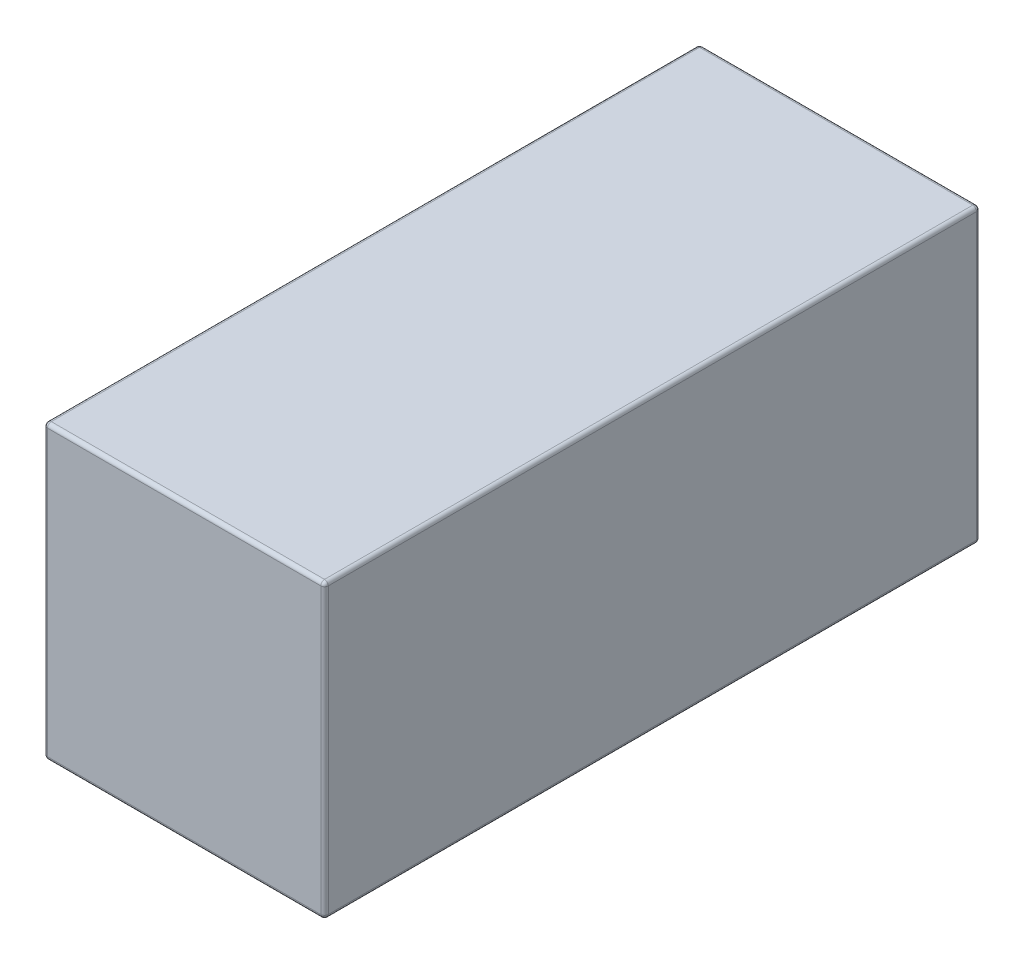
ISO-10303-21;
HEADER;
FILE_DESCRIPTION(('STEP AP214'),'2;1');
FILE_NAME('part.step','',(''),(''),'','','');
FILE_SCHEMA(('AUTOMOTIVE_DESIGN { 1 0 10303 214 1 1 1 1 }'));
ENDSEC;
DATA;
#1=APPLICATION_CONTEXT('core data for automotive mechanical design processes');
#2=APPLICATION_PROTOCOL_DEFINITION('international standard','automotive_design',2000,#1);
#3=PRODUCT_CONTEXT('',#1,'mechanical');
#4=PRODUCT('Part','Part','',(#3));
#5=PRODUCT_RELATED_PRODUCT_CATEGORY('part','',(#4));
#6=PRODUCT_DEFINITION_FORMATION('','',#4);
#7=PRODUCT_DEFINITION_CONTEXT('part definition',#1,'design');
#8=PRODUCT_DEFINITION('design','',#6,#7);
#9=PRODUCT_DEFINITION_SHAPE('','',#8);
#10=(LENGTH_UNIT() NAMED_UNIT(*) SI_UNIT(.MILLI.,.METRE.));
#11=(NAMED_UNIT(*) PLANE_ANGLE_UNIT() SI_UNIT($,.RADIAN.));
#12=(NAMED_UNIT(*) SI_UNIT($,.STERADIAN.) SOLID_ANGLE_UNIT());
#13=UNCERTAINTY_MEASURE_WITH_UNIT(LENGTH_MEASURE(1.E-05),#10,'distance_accuracy_value','');
#14=(GEOMETRIC_REPRESENTATION_CONTEXT(3) GLOBAL_UNCERTAINTY_ASSIGNED_CONTEXT((#13)) GLOBAL_UNIT_ASSIGNED_CONTEXT((#10,
#11,#12)) REPRESENTATION_CONTEXT('',''));
#15=CARTESIAN_POINT('',(0.,0.,0.));
#16=DIRECTION('',(0.,0.,1.));
#17=DIRECTION('',(1.,0.,0.));
#18=AXIS2_PLACEMENT_3D('',#15,#16,#17);
#19=CARTESIAN_POINT('',(18.625,-19.375,43.5));
#20=DIRECTION('',(-1.,0.,0.));
#21=DIRECTION('',(0.,0.,1.));
#22=AXIS2_PLACEMENT_3D('',#19,#20,#21);
#23=PLANE('',#22);
#24=DIRECTION('',(0.,1.,0.));
#25=VECTOR('',#24,1.);
#26=CARTESIAN_POINT('',(18.625,-19.375,43.));
#27=LINE('',#26,#25);
#28=CARTESIAN_POINT('',(18.625,18.875,43.));
#29=VERTEX_POINT('',#28);
#30=CARTESIAN_POINT('',(18.625,-18.875,43.));
#31=VERTEX_POINT('',#30);
#32=EDGE_CURVE('E185',#29,#31,#27,.F.);
#33=ORIENTED_EDGE('',*,*,#32,.T.);
#34=DIRECTION('',(0.,0.,-1.));
#35=VECTOR('',#34,1.);
#36=CARTESIAN_POINT('',(18.625,-18.875,43.5));
#37=LINE('',#36,#35);
#38=CARTESIAN_POINT('',(18.625,-18.875,-43.));
#39=VERTEX_POINT('',#38);
#40=EDGE_CURVE('E139',#31,#39,#37,.T.);
#41=ORIENTED_EDGE('',*,*,#40,.T.);
#42=DIRECTION('',(0.,1.,0.));
#43=VECTOR('',#42,1.);
#44=CARTESIAN_POINT('',(18.625,19.375,-43.));
#45=LINE('',#44,#43);
#46=CARTESIAN_POINT('',(18.625,18.875,-43.));
#47=VERTEX_POINT('',#46);
#48=EDGE_CURVE('E187',#39,#47,#45,.T.);
#49=ORIENTED_EDGE('',*,*,#48,.T.);
#50=DIRECTION('',(0.,0.,-1.));
#51=VECTOR('',#50,1.);
#52=CARTESIAN_POINT('',(18.625,18.875,43.5));
#53=LINE('',#52,#51);
#54=EDGE_CURVE('E183',#47,#29,#53,.F.);
#55=ORIENTED_EDGE('',*,*,#54,.T.);
#56=EDGE_LOOP('',(#33,#41,#49,#55));
#57=FACE_BOUND('',#56,.T.);
#58=ADVANCED_FACE('F33',(#57),#23,.F.);
#59=CARTESIAN_POINT('',(-18.625,19.375,43.5));
#60=DIRECTION('',(0.,-1.,0.));
#61=DIRECTION('',(0.,0.,-1.));
#62=AXIS2_PLACEMENT_3D('',#59,#60,#61);
#63=PLANE('',#62);
#64=DIRECTION('',(-1.,0.,0.));
#65=VECTOR('',#64,1.);
#66=CARTESIAN_POINT('',(-18.625,19.375,43.));
#67=LINE('',#66,#65);
#68=CARTESIAN_POINT('',(-18.125,19.375,43.));
#69=VERTEX_POINT('',#68);
#70=CARTESIAN_POINT('',(18.125,19.375,43.));
#71=VERTEX_POINT('',#70);
#72=EDGE_CURVE('E42',#69,#71,#67,.F.);
#73=ORIENTED_EDGE('',*,*,#72,.T.);
#74=DIRECTION('',(0.,0.,-1.));
#75=VECTOR('',#74,1.);
#76=CARTESIAN_POINT('',(18.125,19.375,43.5));
#77=LINE('',#76,#75);
#78=CARTESIAN_POINT('',(18.125,19.375,-43.));
#79=VERTEX_POINT('',#78);
#80=EDGE_CURVE('E11',#71,#79,#77,.T.);
#81=ORIENTED_EDGE('',*,*,#80,.T.);
#82=DIRECTION('',(-1.,0.,0.));
#83=VECTOR('',#82,1.);
#84=CARTESIAN_POINT('',(-18.625,19.375,-43.));
#85=LINE('',#84,#83);
#86=CARTESIAN_POINT('',(-18.125,19.375,-43.));
#87=VERTEX_POINT('',#86);
#88=EDGE_CURVE('E199',#79,#87,#85,.T.);
#89=ORIENTED_EDGE('',*,*,#88,.T.);
#90=DIRECTION('',(0.,0.,-1.));
#91=VECTOR('',#90,1.);
#92=CARTESIAN_POINT('',(-18.125,19.375,43.5));
#93=LINE('',#92,#91);
#94=EDGE_CURVE('E53',#87,#69,#93,.F.);
#95=ORIENTED_EDGE('',*,*,#94,.T.);
#96=EDGE_LOOP('',(#73,#81,#89,#95));
#97=FACE_BOUND('',#96,.T.);
#98=ADVANCED_FACE('F272',(#97),#63,.F.);
#99=CARTESIAN_POINT('',(-18.625,-19.375,43.5));
#100=DIRECTION('',(1.,0.,0.));
#101=DIRECTION('',(0.,0.,-1.));
#102=AXIS2_PLACEMENT_3D('',#99,#100,#101);
#103=PLANE('',#102);
#104=DIRECTION('',(0.,-1.,0.));
#105=VECTOR('',#104,1.);
#106=CARTESIAN_POINT('',(-18.625,-19.375,-43.));
#107=LINE('',#106,#105);
#108=CARTESIAN_POINT('',(-18.625,18.875,-43.));
#109=VERTEX_POINT('',#108);
#110=CARTESIAN_POINT('',(-18.625,-18.875,-43.));
#111=VERTEX_POINT('',#110);
#112=EDGE_CURVE('E169',#109,#111,#107,.T.);
#113=ORIENTED_EDGE('',*,*,#112,.T.);
#114=DIRECTION('',(0.,0.,-1.));
#115=VECTOR('',#114,1.);
#116=CARTESIAN_POINT('',(-18.625,-18.875,43.5));
#117=LINE('',#116,#115);
#118=CARTESIAN_POINT('',(-18.625,-18.875,43.));
#119=VERTEX_POINT('',#118);
#120=EDGE_CURVE('E171',#111,#119,#117,.F.);
#121=ORIENTED_EDGE('',*,*,#120,.T.);
#122=DIRECTION('',(0.,-1.,0.));
#123=VECTOR('',#122,1.);
#124=CARTESIAN_POINT('',(-18.625,-19.375,43.));
#125=LINE('',#124,#123);
#126=CARTESIAN_POINT('',(-18.625,18.875,43.));
#127=VERTEX_POINT('',#126);
#128=EDGE_CURVE('E167',#119,#127,#125,.F.);
#129=ORIENTED_EDGE('',*,*,#128,.T.);
#130=DIRECTION('',(0.,0.,-1.));
#131=VECTOR('',#130,1.);
#132=CARTESIAN_POINT('',(-18.625,18.875,43.5));
#133=LINE('',#132,#131);
#134=EDGE_CURVE('E165',#127,#109,#133,.T.);
#135=ORIENTED_EDGE('',*,*,#134,.T.);
#136=EDGE_LOOP('',(#113,#121,#129,#135));
#137=FACE_BOUND('',#136,.T.);
#138=ADVANCED_FACE('F332',(#137),#103,.F.);
#139=CARTESIAN_POINT('',(-18.625,-19.375,43.5));
#140=DIRECTION('',(0.,1.,0.));
#141=DIRECTION('',(0.,0.,1.));
#142=AXIS2_PLACEMENT_3D('',#139,#140,#141);
#143=PLANE('',#142);
#144=DIRECTION('',(1.,0.,0.));
#145=VECTOR('',#144,1.);
#146=CARTESIAN_POINT('',(-18.625,-19.375,43.));
#147=LINE('',#146,#145);
#148=CARTESIAN_POINT('',(18.125,-19.375,43.));
#149=VERTEX_POINT('',#148);
#150=CARTESIAN_POINT('',(-18.125,-19.375,43.));
#151=VERTEX_POINT('',#150);
#152=EDGE_CURVE('E125',#149,#151,#147,.F.);
#153=ORIENTED_EDGE('',*,*,#152,.T.);
#154=DIRECTION('',(0.,0.,-1.));
#155=VECTOR('',#154,1.);
#156=CARTESIAN_POINT('',(-18.125,-19.375,43.5));
#157=LINE('',#156,#155);
#158=CARTESIAN_POINT('',(-18.125,-19.375,-43.));
#159=VERTEX_POINT('',#158);
#160=EDGE_CURVE('E163',#151,#159,#157,.T.);
#161=ORIENTED_EDGE('',*,*,#160,.T.);
#162=DIRECTION('',(1.,0.,0.));
#163=VECTOR('',#162,1.);
#164=CARTESIAN_POINT('',(18.625,-19.375,-43.));
#165=LINE('',#164,#163);
#166=CARTESIAN_POINT('',(18.125,-19.375,-43.));
#167=VERTEX_POINT('',#166);
#168=EDGE_CURVE('E128',#159,#167,#165,.T.);
#169=ORIENTED_EDGE('',*,*,#168,.T.);
#170=DIRECTION('',(0.,0.,-1.));
#171=VECTOR('',#170,1.);
#172=CARTESIAN_POINT('',(18.125,-19.375,43.5));
#173=LINE('',#172,#171);
#174=EDGE_CURVE('E120',#167,#149,#173,.F.);
#175=ORIENTED_EDGE('',*,*,#174,.T.);
#176=EDGE_LOOP('',(#153,#161,#169,#175));
#177=FACE_BOUND('',#176,.T.);
#178=ADVANCED_FACE('F122',(#177),#143,.F.);
#179=CARTESIAN_POINT('',(0.,0.,43.5));
#180=DIRECTION('',(0.,0.,-1.));
#181=DIRECTION('',(-1.,0.,0.));
#182=AXIS2_PLACEMENT_3D('',#179,#180,#181);
#183=PLANE('',#182);
#184=DIRECTION('',(0.,-1.,0.));
#185=VECTOR('',#184,1.);
#186=CARTESIAN_POINT('',(-18.125,0.,43.5));
#187=LINE('',#186,#185);
#188=CARTESIAN_POINT('',(-18.125,18.875,43.5));
#189=VERTEX_POINT('',#188);
#190=CARTESIAN_POINT('',(-18.125,-18.875,43.5));
#191=VERTEX_POINT('',#190);
#192=EDGE_CURVE('E194',#189,#191,#187,.T.);
#193=ORIENTED_EDGE('',*,*,#192,.T.);
#194=DIRECTION('',(1.,0.,0.));
#195=VECTOR('',#194,1.);
#196=CARTESIAN_POINT('',(0.,-18.875,43.5));
#197=LINE('',#196,#195);
#198=CARTESIAN_POINT('',(18.125,-18.875,43.5));
#199=VERTEX_POINT('',#198);
#200=EDGE_CURVE('E196',#191,#199,#197,.T.);
#201=ORIENTED_EDGE('',*,*,#200,.T.);
#202=DIRECTION('',(0.,1.,0.));
#203=VECTOR('',#202,1.);
#204=CARTESIAN_POINT('',(18.125,0.,43.5));
#205=LINE('',#204,#203);
#206=CARTESIAN_POINT('',(18.125,18.875,43.5));
#207=VERTEX_POINT('',#206);
#208=EDGE_CURVE('E192',#199,#207,#205,.T.);
#209=ORIENTED_EDGE('',*,*,#208,.T.);
#210=DIRECTION('',(-1.,0.,0.));
#211=VECTOR('',#210,1.);
#212=CARTESIAN_POINT('',(0.,18.875,43.5));
#213=LINE('',#212,#211);
#214=EDGE_CURVE('E190',#207,#189,#213,.T.);
#215=ORIENTED_EDGE('',*,*,#214,.T.);
#216=EDGE_LOOP('',(#193,#201,#209,#215));
#217=FACE_BOUND('',#216,.T.);
#218=ADVANCED_FACE('F297',(#217),#183,.F.);
#219=CARTESIAN_POINT('',(0.,0.,-43.5));
#220=DIRECTION('',(0.,0.,-1.));
#221=DIRECTION('',(-1.,0.,0.));
#222=AXIS2_PLACEMENT_3D('',#219,#220,#221);
#223=PLANE('',#222);
#224=DIRECTION('',(1.,0.,0.));
#225=VECTOR('',#224,1.);
#226=CARTESIAN_POINT('',(-18.625,-18.875,-43.5));
#227=LINE('',#226,#225);
#228=CARTESIAN_POINT('',(18.125,-18.875,-43.5));
#229=VERTEX_POINT('',#228);
#230=CARTESIAN_POINT('',(-18.125,-18.875,-43.5));
#231=VERTEX_POINT('',#230);
#232=EDGE_CURVE('E178',#229,#231,#227,.F.);
#233=ORIENTED_EDGE('',*,*,#232,.T.);
#234=DIRECTION('',(0.,-1.,0.));
#235=VECTOR('',#234,1.);
#236=CARTESIAN_POINT('',(-18.125,19.375,-43.5));
#237=LINE('',#236,#235);
#238=CARTESIAN_POINT('',(-18.125,18.875,-43.5));
#239=VERTEX_POINT('',#238);
#240=EDGE_CURVE('E180',#231,#239,#237,.F.);
#241=ORIENTED_EDGE('',*,*,#240,.T.);
#242=DIRECTION('',(-1.,0.,0.));
#243=VECTOR('',#242,1.);
#244=CARTESIAN_POINT('',(18.625,18.875,-43.5));
#245=LINE('',#244,#243);
#246=CARTESIAN_POINT('',(18.125,18.875,-43.5));
#247=VERTEX_POINT('',#246);
#248=EDGE_CURVE('E174',#239,#247,#245,.F.);
#249=ORIENTED_EDGE('',*,*,#248,.T.);
#250=DIRECTION('',(0.,1.,0.));
#251=VECTOR('',#250,1.);
#252=CARTESIAN_POINT('',(18.125,-19.375,-43.5));
#253=LINE('',#252,#251);
#254=EDGE_CURVE('E176',#247,#229,#253,.F.);
#255=ORIENTED_EDGE('',*,*,#254,.T.);
#256=EDGE_LOOP('',(#233,#241,#249,#255));
#257=FACE_BOUND('',#256,.T.);
#258=ADVANCED_FACE('F265',(#257),#223,.T.);
#259=CARTESIAN_POINT('',(18.125,18.875,43.5));
#260=DIRECTION('',(0.,0.,-1.));
#261=DIRECTION('',(-1.,0.,0.));
#262=AXIS2_PLACEMENT_3D('',#259,#260,#261);
#263=CYLINDRICAL_SURFACE('',#262,0.5);
#264=CARTESIAN_POINT('',(18.125,18.875,43.));
#265=DIRECTION('',(0.,0.,1.));
#266=DIRECTION('',(1.,0.,0.));
#267=AXIS2_PLACEMENT_3D('',#264,#265,#266);
#268=CIRCLE('',#267,0.5);
#269=EDGE_CURVE('E37',#29,#71,#268,.T.);
#270=ORIENTED_EDGE('',*,*,#269,.F.);
#271=ORIENTED_EDGE('',*,*,#54,.F.);
#272=CARTESIAN_POINT('',(18.125,18.875,-43.));
#273=DIRECTION('',(0.,0.,-1.));
#274=DIRECTION('',(-1.,0.,0.));
#275=AXIS2_PLACEMENT_3D('',#272,#273,#274);
#276=CIRCLE('',#275,0.5);
#277=EDGE_CURVE('E160',#79,#47,#276,.T.);
#278=ORIENTED_EDGE('',*,*,#277,.F.);
#279=ORIENTED_EDGE('',*,*,#80,.F.);
#280=EDGE_LOOP('',(#270,#271,#278,#279));
#281=FACE_BOUND('',#280,.T.);
#282=ADVANCED_FACE('F35',(#281),#263,.T.);
#283=CARTESIAN_POINT('',(18.125,18.875,43.));
#284=DIRECTION('',(0.,0.,1.));
#285=DIRECTION('',(1.,0.,0.));
#286=AXIS2_PLACEMENT_3D('',#283,#284,#285);
#287=SPHERICAL_SURFACE('',#286,0.5);
#288=CARTESIAN_POINT('',(18.125,18.875,43.));
#289=DIRECTION('',(0.,1.,0.));
#290=DIRECTION('',(0.,0.,1.));
#291=AXIS2_PLACEMENT_3D('',#288,#289,#290);
#292=CIRCLE('',#291,0.5);
#293=EDGE_CURVE('E245',#29,#207,#292,.F.);
#294=ORIENTED_EDGE('',*,*,#293,.F.);
#295=ORIENTED_EDGE('',*,*,#269,.T.);
#296=CARTESIAN_POINT('',(18.125,18.875,43.));
#297=DIRECTION('',(1.,0.,0.));
#298=DIRECTION('',(0.,0.,-1.));
#299=AXIS2_PLACEMENT_3D('',#296,#297,#298);
#300=CIRCLE('',#299,0.5);
#301=EDGE_CURVE('E248',#207,#71,#300,.F.);
#302=ORIENTED_EDGE('',*,*,#301,.F.);
#303=EDGE_LOOP('',(#294,#295,#302));
#304=FACE_BOUND('',#303,.T.);
#305=ADVANCED_FACE('F290',(#304),#287,.T.);
#306=CARTESIAN_POINT('',(18.125,18.875,-43.));
#307=DIRECTION('',(0.,0.,1.));
#308=DIRECTION('',(1.,0.,0.));
#309=AXIS2_PLACEMENT_3D('',#306,#307,#308);
#310=SPHERICAL_SURFACE('',#309,0.5);
#311=CARTESIAN_POINT('',(18.125,18.875,-43.));
#312=DIRECTION('',(1.,0.,0.));
#313=DIRECTION('',(0.,0.,-1.));
#314=AXIS2_PLACEMENT_3D('',#311,#312,#313);
#315=CIRCLE('',#314,0.5);
#316=EDGE_CURVE('E239',#79,#247,#315,.F.);
#317=ORIENTED_EDGE('',*,*,#316,.F.);
#318=ORIENTED_EDGE('',*,*,#277,.T.);
#319=CARTESIAN_POINT('',(18.125,18.875,-43.));
#320=DIRECTION('',(0.,1.,0.));
#321=DIRECTION('',(0.,0.,1.));
#322=AXIS2_PLACEMENT_3D('',#319,#320,#321);
#323=CIRCLE('',#322,0.5);
#324=EDGE_CURVE('E242',#247,#47,#323,.F.);
#325=ORIENTED_EDGE('',*,*,#324,.F.);
#326=EDGE_LOOP('',(#317,#318,#325));
#327=FACE_BOUND('',#326,.T.);
#328=ADVANCED_FACE('F255',(#327),#310,.T.);
#329=CARTESIAN_POINT('',(0.,18.875,43.));
#330=DIRECTION('',(-1.,0.,0.));
#331=DIRECTION('',(0.,0.,1.));
#332=AXIS2_PLACEMENT_3D('',#329,#330,#331);
#333=CYLINDRICAL_SURFACE('',#332,0.5);
#334=ORIENTED_EDGE('',*,*,#301,.T.);
#335=ORIENTED_EDGE('',*,*,#72,.F.);
#336=CARTESIAN_POINT('',(-18.125,18.875,43.));
#337=DIRECTION('',(-1.,0.,0.));
#338=DIRECTION('',(0.,0.,1.));
#339=AXIS2_PLACEMENT_3D('',#336,#337,#338);
#340=CIRCLE('',#339,0.5);
#341=EDGE_CURVE('E233',#189,#69,#340,.T.);
#342=ORIENTED_EDGE('',*,*,#341,.F.);
#343=ORIENTED_EDGE('',*,*,#214,.F.);
#344=EDGE_LOOP('',(#334,#335,#342,#343));
#345=FACE_BOUND('',#344,.T.);
#346=ADVANCED_FACE('F286',(#345),#333,.T.);
#347=CARTESIAN_POINT('',(18.125,0.,43.));
#348=DIRECTION('',(0.,1.,0.));
#349=DIRECTION('',(0.,0.,1.));
#350=AXIS2_PLACEMENT_3D('',#347,#348,#349);
#351=CYLINDRICAL_SURFACE('',#350,0.5);
#352=ORIENTED_EDGE('',*,*,#293,.T.);
#353=ORIENTED_EDGE('',*,*,#208,.F.);
#354=CARTESIAN_POINT('',(18.125,-18.875,43.));
#355=DIRECTION('',(0.,-1.,0.));
#356=DIRECTION('',(0.,0.,-1.));
#357=AXIS2_PLACEMENT_3D('',#354,#355,#356);
#358=CIRCLE('',#357,0.5);
#359=EDGE_CURVE('E143',#31,#199,#358,.T.);
#360=ORIENTED_EDGE('',*,*,#359,.F.);
#361=ORIENTED_EDGE('',*,*,#32,.F.);
#362=EDGE_LOOP('',(#352,#353,#360,#361));
#363=FACE_BOUND('',#362,.T.);
#364=ADVANCED_FACE('F295',(#363),#351,.T.);
#365=CARTESIAN_POINT('',(18.125,-18.875,43.5));
#366=DIRECTION('',(0.,0.,-1.));
#367=DIRECTION('',(-1.,0.,0.));
#368=AXIS2_PLACEMENT_3D('',#365,#366,#367);
#369=CYLINDRICAL_SURFACE('',#368,0.5);
#370=CARTESIAN_POINT('',(18.125,-18.875,-43.));
#371=DIRECTION('',(0.,0.,-1.));
#372=DIRECTION('',(-1.,0.,0.));
#373=AXIS2_PLACEMENT_3D('',#370,#371,#372);
#374=CIRCLE('',#373,0.5);
#375=EDGE_CURVE('E144',#39,#167,#374,.T.);
#376=ORIENTED_EDGE('',*,*,#375,.F.);
#377=ORIENTED_EDGE('',*,*,#40,.F.);
#378=CARTESIAN_POINT('',(18.125,-18.875,43.));
#379=DIRECTION('',(0.,0.,1.));
#380=DIRECTION('',(1.,0.,0.));
#381=AXIS2_PLACEMENT_3D('',#378,#379,#380);
#382=CIRCLE('',#381,0.5);
#383=EDGE_CURVE('E135',#149,#31,#382,.T.);
#384=ORIENTED_EDGE('',*,*,#383,.F.);
#385=ORIENTED_EDGE('',*,*,#174,.F.);
#386=EDGE_LOOP('',(#376,#377,#384,#385));
#387=FACE_BOUND('',#386,.T.);
#388=ADVANCED_FACE('F137',(#387),#369,.T.);
#389=CARTESIAN_POINT('',(18.125,-19.375,-43.));
#390=DIRECTION('',(0.,-1.,0.));
#391=DIRECTION('',(0.,0.,-1.));
#392=AXIS2_PLACEMENT_3D('',#389,#390,#391);
#393=CYLINDRICAL_SURFACE('',#392,0.5);
#394=ORIENTED_EDGE('',*,*,#324,.T.);
#395=ORIENTED_EDGE('',*,*,#48,.F.);
#396=CARTESIAN_POINT('',(18.125,-18.875,-43.));
#397=DIRECTION('',(0.,-1.,0.));
#398=DIRECTION('',(0.,0.,-1.));
#399=AXIS2_PLACEMENT_3D('',#396,#397,#398);
#400=CIRCLE('',#399,0.5);
#401=EDGE_CURVE('E229',#229,#39,#400,.T.);
#402=ORIENTED_EDGE('',*,*,#401,.F.);
#403=ORIENTED_EDGE('',*,*,#254,.F.);
#404=EDGE_LOOP('',(#394,#395,#402,#403));
#405=FACE_BOUND('',#404,.T.);
#406=ADVANCED_FACE('F261',(#405),#393,.T.);
#407=CARTESIAN_POINT('',(-18.625,18.875,-43.));
#408=DIRECTION('',(1.,0.,0.));
#409=DIRECTION('',(0.,0.,-1.));
#410=AXIS2_PLACEMENT_3D('',#407,#408,#409);
#411=CYLINDRICAL_SURFACE('',#410,0.5);
#412=ORIENTED_EDGE('',*,*,#316,.T.);
#413=ORIENTED_EDGE('',*,*,#248,.F.);
#414=CARTESIAN_POINT('',(-18.125,18.875,-43.));
#415=DIRECTION('',(-1.,0.,0.));
#416=DIRECTION('',(0.,0.,1.));
#417=AXIS2_PLACEMENT_3D('',#414,#415,#416);
#418=CIRCLE('',#417,0.5);
#419=EDGE_CURVE('E226',#87,#239,#418,.T.);
#420=ORIENTED_EDGE('',*,*,#419,.F.);
#421=ORIENTED_EDGE('',*,*,#88,.F.);
#422=EDGE_LOOP('',(#412,#413,#420,#421));
#423=FACE_BOUND('',#422,.T.);
#424=ADVANCED_FACE('F271',(#423),#411,.T.);
#425=CARTESIAN_POINT('',(-18.125,18.875,43.5));
#426=DIRECTION('',(0.,0.,-1.));
#427=DIRECTION('',(-1.,0.,0.));
#428=AXIS2_PLACEMENT_3D('',#425,#426,#427);
#429=CYLINDRICAL_SURFACE('',#428,0.5);
#430=CARTESIAN_POINT('',(-18.125,18.875,43.));
#431=DIRECTION('',(0.,0.,1.));
#432=DIRECTION('',(1.,0.,0.));
#433=AXIS2_PLACEMENT_3D('',#430,#431,#432);
#434=CIRCLE('',#433,0.5);
#435=EDGE_CURVE('E236',#69,#127,#434,.T.);
#436=ORIENTED_EDGE('',*,*,#435,.F.);
#437=ORIENTED_EDGE('',*,*,#94,.F.);
#438=CARTESIAN_POINT('',(-18.125,18.875,-43.));
#439=DIRECTION('',(0.,0.,-1.));
#440=DIRECTION('',(-1.,0.,0.));
#441=AXIS2_PLACEMENT_3D('',#438,#439,#440);
#442=CIRCLE('',#441,0.5);
#443=EDGE_CURVE('E223',#109,#87,#442,.T.);
#444=ORIENTED_EDGE('',*,*,#443,.F.);
#445=ORIENTED_EDGE('',*,*,#134,.F.);
#446=EDGE_LOOP('',(#436,#437,#444,#445));
#447=FACE_BOUND('',#446,.T.);
#448=ADVANCED_FACE('F276',(#447),#429,.T.);
#449=CARTESIAN_POINT('',(-18.125,18.875,43.));
#450=DIRECTION('',(0.,0.,1.));
#451=DIRECTION('',(1.,0.,0.));
#452=AXIS2_PLACEMENT_3D('',#449,#450,#451);
#453=SPHERICAL_SURFACE('',#452,0.5);
#454=ORIENTED_EDGE('',*,*,#341,.T.);
#455=ORIENTED_EDGE('',*,*,#435,.T.);
#456=CARTESIAN_POINT('',(-18.125,18.875,43.));
#457=DIRECTION('',(0.,1.,0.));
#458=DIRECTION('',(0.,0.,1.));
#459=AXIS2_PLACEMENT_3D('',#456,#457,#458);
#460=CIRCLE('',#459,0.5);
#461=EDGE_CURVE('E151',#189,#127,#460,.F.);
#462=ORIENTED_EDGE('',*,*,#461,.F.);
#463=EDGE_LOOP('',(#454,#455,#462));
#464=FACE_BOUND('',#463,.T.);
#465=ADVANCED_FACE('F282',(#464),#453,.T.);
#466=CARTESIAN_POINT('',(18.125,-18.875,43.));
#467=DIRECTION('',(0.,0.,1.));
#468=DIRECTION('',(1.,0.,0.));
#469=AXIS2_PLACEMENT_3D('',#466,#467,#468);
#470=SPHERICAL_SURFACE('',#469,0.5);
#471=ORIENTED_EDGE('',*,*,#383,.T.);
#472=ORIENTED_EDGE('',*,*,#359,.T.);
#473=CARTESIAN_POINT('',(18.125,-18.875,43.));
#474=DIRECTION('',(1.,0.,0.));
#475=DIRECTION('',(0.,0.,-1.));
#476=AXIS2_PLACEMENT_3D('',#473,#474,#475);
#477=CIRCLE('',#476,0.5);
#478=EDGE_CURVE('E146',#149,#199,#477,.F.);
#479=ORIENTED_EDGE('',*,*,#478,.F.);
#480=EDGE_LOOP('',(#471,#472,#479));
#481=FACE_BOUND('',#480,.T.);
#482=ADVANCED_FACE('F147',(#481),#470,.T.);
#483=CARTESIAN_POINT('',(18.125,-18.875,-43.));
#484=DIRECTION('',(0.,0.,1.));
#485=DIRECTION('',(1.,0.,0.));
#486=AXIS2_PLACEMENT_3D('',#483,#484,#485);
#487=SPHERICAL_SURFACE('',#486,0.5);
#488=ORIENTED_EDGE('',*,*,#401,.T.);
#489=ORIENTED_EDGE('',*,*,#375,.T.);
#490=CARTESIAN_POINT('',(18.125,-18.875,-43.));
#491=DIRECTION('',(1.,0.,0.));
#492=DIRECTION('',(0.,0.,-1.));
#493=AXIS2_PLACEMENT_3D('',#490,#491,#492);
#494=CIRCLE('',#493,0.5);
#495=EDGE_CURVE('E152',#229,#167,#494,.F.);
#496=ORIENTED_EDGE('',*,*,#495,.F.);
#497=EDGE_LOOP('',(#488,#489,#496));
#498=FACE_BOUND('',#497,.T.);
#499=ADVANCED_FACE('F316',(#498),#487,.T.);
#500=CARTESIAN_POINT('',(-18.125,18.875,-43.));
#501=DIRECTION('',(0.,0.,1.));
#502=DIRECTION('',(1.,0.,0.));
#503=AXIS2_PLACEMENT_3D('',#500,#501,#502);
#504=SPHERICAL_SURFACE('',#503,0.5);
#505=ORIENTED_EDGE('',*,*,#443,.T.);
#506=ORIENTED_EDGE('',*,*,#419,.T.);
#507=CARTESIAN_POINT('',(-18.125,18.875,-43.));
#508=DIRECTION('',(0.,1.,0.));
#509=DIRECTION('',(0.,0.,1.));
#510=AXIS2_PLACEMENT_3D('',#507,#508,#509);
#511=CIRCLE('',#510,0.5);
#512=EDGE_CURVE('E217',#109,#239,#511,.F.);
#513=ORIENTED_EDGE('',*,*,#512,.F.);
#514=EDGE_LOOP('',(#505,#506,#513));
#515=FACE_BOUND('',#514,.T.);
#516=ADVANCED_FACE('F318',(#515),#504,.T.);
#517=CARTESIAN_POINT('',(-18.125,0.,43.));
#518=DIRECTION('',(0.,-1.,0.));
#519=DIRECTION('',(0.,0.,-1.));
#520=AXIS2_PLACEMENT_3D('',#517,#518,#519);
#521=CYLINDRICAL_SURFACE('',#520,0.5);
#522=ORIENTED_EDGE('',*,*,#461,.T.);
#523=ORIENTED_EDGE('',*,*,#128,.F.);
#524=CARTESIAN_POINT('',(-18.125,-18.875,43.));
#525=DIRECTION('',(0.,-1.,0.));
#526=DIRECTION('',(0.,0.,-1.));
#527=AXIS2_PLACEMENT_3D('',#524,#525,#526);
#528=CIRCLE('',#527,0.5);
#529=EDGE_CURVE('E214',#191,#119,#528,.T.);
#530=ORIENTED_EDGE('',*,*,#529,.F.);
#531=ORIENTED_EDGE('',*,*,#192,.F.);
#532=EDGE_LOOP('',(#522,#523,#530,#531));
#533=FACE_BOUND('',#532,.T.);
#534=ADVANCED_FACE('F301',(#533),#521,.T.);
#535=CARTESIAN_POINT('',(0.,-18.875,43.));
#536=DIRECTION('',(1.,0.,0.));
#537=DIRECTION('',(0.,0.,-1.));
#538=AXIS2_PLACEMENT_3D('',#535,#536,#537);
#539=CYLINDRICAL_SURFACE('',#538,0.5);
#540=ORIENTED_EDGE('',*,*,#478,.T.);
#541=ORIENTED_EDGE('',*,*,#200,.F.);
#542=CARTESIAN_POINT('',(-18.125,-18.875,43.));
#543=DIRECTION('',(-1.,0.,0.));
#544=DIRECTION('',(0.,0.,1.));
#545=AXIS2_PLACEMENT_3D('',#542,#543,#544);
#546=CIRCLE('',#545,0.5);
#547=EDGE_CURVE('E156',#151,#191,#546,.T.);
#548=ORIENTED_EDGE('',*,*,#547,.F.);
#549=ORIENTED_EDGE('',*,*,#152,.F.);
#550=EDGE_LOOP('',(#540,#541,#548,#549));
#551=FACE_BOUND('',#550,.T.);
#552=ADVANCED_FACE('F154',(#551),#539,.T.);
#553=CARTESIAN_POINT('',(-18.625,-18.875,-43.));
#554=DIRECTION('',(-1.,0.,0.));
#555=DIRECTION('',(0.,0.,1.));
#556=AXIS2_PLACEMENT_3D('',#553,#554,#555);
#557=CYLINDRICAL_SURFACE('',#556,0.5);
#558=ORIENTED_EDGE('',*,*,#495,.T.);
#559=ORIENTED_EDGE('',*,*,#168,.F.);
#560=CARTESIAN_POINT('',(-18.125,-18.875,-43.));
#561=DIRECTION('',(-1.,0.,0.));
#562=DIRECTION('',(0.,0.,1.));
#563=AXIS2_PLACEMENT_3D('',#560,#561,#562);
#564=CIRCLE('',#563,0.5);
#565=EDGE_CURVE('E210',#231,#159,#564,.T.);
#566=ORIENTED_EDGE('',*,*,#565,.F.);
#567=ORIENTED_EDGE('',*,*,#232,.F.);
#568=EDGE_LOOP('',(#558,#559,#566,#567));
#569=FACE_BOUND('',#568,.T.);
#570=ADVANCED_FACE('F314',(#569),#557,.T.);
#571=CARTESIAN_POINT('',(-18.125,-19.375,-43.));
#572=DIRECTION('',(0.,1.,0.));
#573=DIRECTION('',(0.,0.,1.));
#574=AXIS2_PLACEMENT_3D('',#571,#572,#573);
#575=CYLINDRICAL_SURFACE('',#574,0.5);
#576=ORIENTED_EDGE('',*,*,#512,.T.);
#577=ORIENTED_EDGE('',*,*,#240,.F.);
#578=CARTESIAN_POINT('',(-18.125,-18.875,-43.));
#579=DIRECTION('',(0.,-1.,0.));
#580=DIRECTION('',(0.,0.,-1.));
#581=AXIS2_PLACEMENT_3D('',#578,#579,#580);
#582=CIRCLE('',#581,0.5);
#583=EDGE_CURVE('E207',#111,#231,#582,.T.);
#584=ORIENTED_EDGE('',*,*,#583,.F.);
#585=ORIENTED_EDGE('',*,*,#112,.F.);
#586=EDGE_LOOP('',(#576,#577,#584,#585));
#587=FACE_BOUND('',#586,.T.);
#588=ADVANCED_FACE('F342',(#587),#575,.T.);
#589=CARTESIAN_POINT('',(-18.125,-18.875,43.));
#590=DIRECTION('',(0.,0.,1.));
#591=DIRECTION('',(1.,0.,0.));
#592=AXIS2_PLACEMENT_3D('',#589,#590,#591);
#593=SPHERICAL_SURFACE('',#592,0.5);
#594=ORIENTED_EDGE('',*,*,#547,.T.);
#595=ORIENTED_EDGE('',*,*,#529,.T.);
#596=CARTESIAN_POINT('',(-18.125,-18.875,43.));
#597=DIRECTION('',(0.,0.,1.));
#598=DIRECTION('',(1.,0.,0.));
#599=AXIS2_PLACEMENT_3D('',#596,#597,#598);
#600=CIRCLE('',#599,0.5);
#601=EDGE_CURVE('E205',#151,#119,#600,.F.);
#602=ORIENTED_EDGE('',*,*,#601,.F.);
#603=EDGE_LOOP('',(#594,#595,#602));
#604=FACE_BOUND('',#603,.T.);
#605=ADVANCED_FACE('F303',(#604),#593,.T.);
#606=CARTESIAN_POINT('',(-18.125,-18.875,-43.));
#607=DIRECTION('',(0.,0.,1.));
#608=DIRECTION('',(1.,0.,0.));
#609=AXIS2_PLACEMENT_3D('',#606,#607,#608);
#610=SPHERICAL_SURFACE('',#609,0.5);
#611=ORIENTED_EDGE('',*,*,#583,.T.);
#612=ORIENTED_EDGE('',*,*,#565,.T.);
#613=CARTESIAN_POINT('',(-18.125,-18.875,-43.));
#614=DIRECTION('',(0.,0.,-1.));
#615=DIRECTION('',(-1.,0.,0.));
#616=AXIS2_PLACEMENT_3D('',#613,#614,#615);
#617=CIRCLE('',#616,0.5);
#618=EDGE_CURVE('E203',#111,#159,#617,.F.);
#619=ORIENTED_EDGE('',*,*,#618,.F.);
#620=EDGE_LOOP('',(#611,#612,#619));
#621=FACE_BOUND('',#620,.T.);
#622=ADVANCED_FACE('F311',(#621),#610,.T.);
#623=CARTESIAN_POINT('',(-18.125,-18.875,43.5));
#624=DIRECTION('',(0.,0.,-1.));
#625=DIRECTION('',(-1.,0.,0.));
#626=AXIS2_PLACEMENT_3D('',#623,#624,#625);
#627=CYLINDRICAL_SURFACE('',#626,0.5);
#628=ORIENTED_EDGE('',*,*,#601,.T.);
#629=ORIENTED_EDGE('',*,*,#120,.F.);
#630=ORIENTED_EDGE('',*,*,#618,.T.);
#631=ORIENTED_EDGE('',*,*,#160,.F.);
#632=EDGE_LOOP('',(#628,#629,#630,#631));
#633=FACE_BOUND('',#632,.T.);
#634=ADVANCED_FACE('F307',(#633),#627,.T.);
#635=CLOSED_SHELL('',(#58,#98,#138,#178,#218,#258,#282,#305,#328,#346,#364,#388,#406,#424,#448,
#465,#482,#499,#516,#534,#552,#570,#588,#605,#622,#634));
#636=MANIFOLD_SOLID_BREP('B2',#635);
#637=ADVANCED_BREP_SHAPE_REPRESENTATION('',(#18,#636),#14);
#638=SHAPE_DEFINITION_REPRESENTATION(#9,#637);
ENDSEC;
END-ISO-10303-21;
